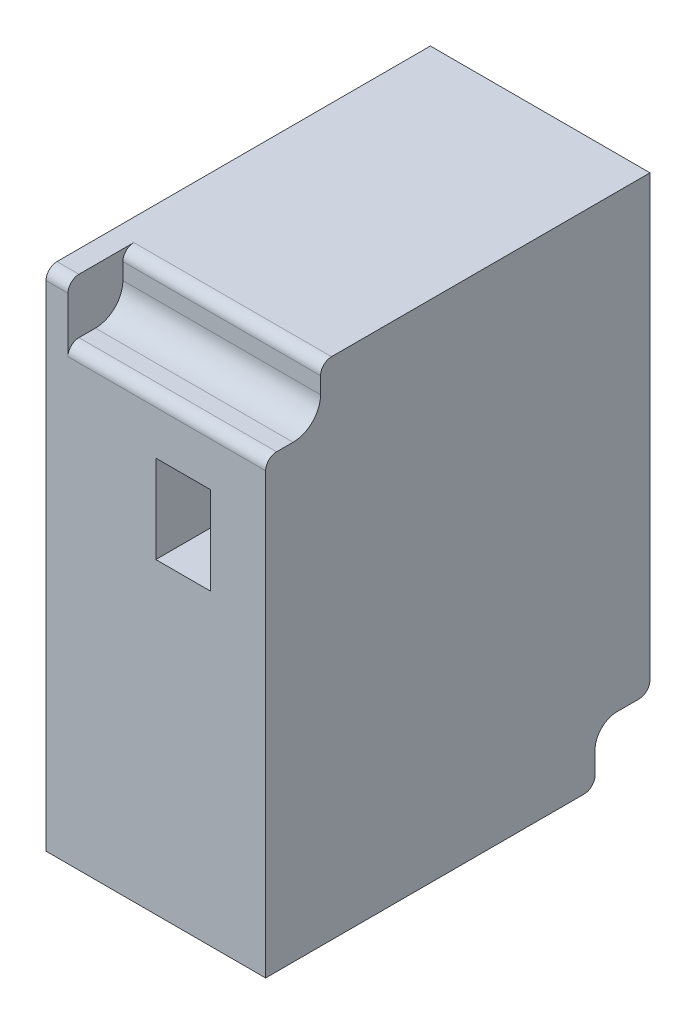
ISO-10303-21;
HEADER;
FILE_DESCRIPTION(('STEP AP214'),'2;1');
FILE_NAME('part.step','',(''),(''),'','','');
FILE_SCHEMA(('AUTOMOTIVE_DESIGN { 1 0 10303 214 1 1 1 1 }'));
ENDSEC;
DATA;
#1=APPLICATION_CONTEXT('core data for automotive mechanical design processes');
#2=APPLICATION_PROTOCOL_DEFINITION('international standard','automotive_design',2000,#1);
#3=PRODUCT_CONTEXT('',#1,'mechanical');
#4=PRODUCT('Part','Part','',(#3));
#5=PRODUCT_RELATED_PRODUCT_CATEGORY('part','',(#4));
#6=PRODUCT_DEFINITION_FORMATION('','',#4);
#7=PRODUCT_DEFINITION_CONTEXT('part definition',#1,'design');
#8=PRODUCT_DEFINITION('design','',#6,#7);
#9=PRODUCT_DEFINITION_SHAPE('','',#8);
#10=(LENGTH_UNIT() NAMED_UNIT(*) SI_UNIT(.MILLI.,.METRE.));
#11=(NAMED_UNIT(*) PLANE_ANGLE_UNIT() SI_UNIT($,.RADIAN.));
#12=(NAMED_UNIT(*) SI_UNIT($,.STERADIAN.) SOLID_ANGLE_UNIT());
#13=UNCERTAINTY_MEASURE_WITH_UNIT(LENGTH_MEASURE(1.E-05),#10,'distance_accuracy_value','');
#14=(GEOMETRIC_REPRESENTATION_CONTEXT(3) GLOBAL_UNCERTAINTY_ASSIGNED_CONTEXT((#13)) GLOBAL_UNIT_ASSIGNED_CONTEXT((#10,
#11,#12)) REPRESENTATION_CONTEXT('',''));
#15=CARTESIAN_POINT('',(0.,0.,0.));
#16=DIRECTION('',(0.,0.,1.));
#17=DIRECTION('',(1.,0.,0.));
#18=AXIS2_PLACEMENT_3D('',#15,#16,#17);
#19=CARTESIAN_POINT('',(0.,46.,-35.));
#20=DIRECTION('',(-1.,0.,0.));
#21=DIRECTION('',(0.,0.,1.));
#22=AXIS2_PLACEMENT_3D('',#19,#20,#21);
#23=PLANE('',#22);
#24=DIRECTION('',(0.,-1.,0.));
#25=VECTOR('',#24,1.);
#26=CARTESIAN_POINT('',(0.,46.,-35.));
#27=LINE('',#26,#25);
#28=CARTESIAN_POINT('',(0.,46.,-35.));
#29=VERTEX_POINT('',#28);
#30=CARTESIAN_POINT('',(0.,1.,-35.));
#31=VERTEX_POINT('',#30);
#32=EDGE_CURVE('E247',#29,#31,#27,.T.);
#33=ORIENTED_EDGE('',*,*,#32,.T.);
#34=CARTESIAN_POINT('',(0.,1.,-34.));
#35=DIRECTION('',(-1.,0.,0.));
#36=DIRECTION('',(0.,0.,1.));
#37=AXIS2_PLACEMENT_3D('',#34,#35,#36);
#38=CIRCLE('',#37,1.);
#39=CARTESIAN_POINT('',(0.,0.,-34.));
#40=VERTEX_POINT('',#39);
#41=EDGE_CURVE('E334',#31,#40,#38,.T.);
#42=ORIENTED_EDGE('',*,*,#41,.T.);
#43=DIRECTION('',(0.,0.,1.));
#44=VECTOR('',#43,1.);
#45=CARTESIAN_POINT('',(0.,0.,-35.));
#46=LINE('',#45,#44);
#47=CARTESIAN_POINT('',(0.,0.,0.));
#48=VERTEX_POINT('',#47);
#49=EDGE_CURVE('E256',#40,#48,#46,.T.);
#50=ORIENTED_EDGE('',*,*,#49,.T.);
#51=DIRECTION('',(0.,-1.,0.));
#52=VECTOR('',#51,1.);
#53=CARTESIAN_POINT('',(0.,46.,0.));
#54=LINE('',#53,#52);
#55=CARTESIAN_POINT('',(0.,45.,0.));
#56=VERTEX_POINT('',#55);
#57=EDGE_CURVE('E227',#56,#48,#54,.T.);
#58=ORIENTED_EDGE('',*,*,#57,.F.);
#59=CARTESIAN_POINT('',(0.,45.,-1.));
#60=DIRECTION('',(-1.,0.,0.));
#61=DIRECTION('',(0.,0.,1.));
#62=AXIS2_PLACEMENT_3D('',#59,#60,#61);
#63=CIRCLE('',#62,1.);
#64=CARTESIAN_POINT('',(0.,46.,-1.));
#65=VERTEX_POINT('',#64);
#66=EDGE_CURVE('E286',#56,#65,#63,.T.);
#67=ORIENTED_EDGE('',*,*,#66,.T.);
#68=DIRECTION('',(0.,0.,1.));
#69=VECTOR('',#68,1.);
#70=CARTESIAN_POINT('',(0.,46.,-35.));
#71=LINE('',#70,#69);
#72=EDGE_CURVE('E264',#29,#65,#71,.T.);
#73=ORIENTED_EDGE('',*,*,#72,.F.);
#74=EDGE_LOOP('',(#33,#42,#50,#58,#67,#73));
#75=FACE_BOUND('',#74,.T.);
#76=ADVANCED_FACE('F33',(#75),#23,.T.);
#77=CARTESIAN_POINT('',(20.,46.,-35.));
#78=DIRECTION('',(0.,1.,0.));
#79=DIRECTION('',(0.,0.,1.));
#80=AXIS2_PLACEMENT_3D('',#77,#78,#79);
#81=PLANE('',#80);
#82=DIRECTION('',(0.,0.,1.));
#83=VECTOR('',#82,1.);
#84=CARTESIAN_POINT('',(2.,46.,-5.));
#85=LINE('',#84,#83);
#86=CARTESIAN_POINT('',(2.,46.,-6.));
#87=VERTEX_POINT('',#86);
#88=CARTESIAN_POINT('',(2.,46.,-1.));
#89=VERTEX_POINT('',#88);
#90=EDGE_CURVE('E242',#87,#89,#85,.T.);
#91=ORIENTED_EDGE('',*,*,#90,.F.);
#92=DIRECTION('',(-1.,0.,0.));
#93=VECTOR('',#92,1.);
#94=CARTESIAN_POINT('',(20.,46.,-6.));
#95=LINE('',#94,#93);
#96=CARTESIAN_POINT('',(20.,46.,-6.));
#97=VERTEX_POINT('',#96);
#98=EDGE_CURVE('E305',#87,#97,#95,.F.);
#99=ORIENTED_EDGE('',*,*,#98,.T.);
#100=DIRECTION('',(0.,0.,1.));
#101=VECTOR('',#100,1.);
#102=CARTESIAN_POINT('',(20.,46.,-35.));
#103=LINE('',#102,#101);
#104=CARTESIAN_POINT('',(20.,46.,-35.));
#105=VERTEX_POINT('',#104);
#106=EDGE_CURVE('E268',#105,#97,#103,.T.);
#107=ORIENTED_EDGE('',*,*,#106,.F.);
#108=DIRECTION('',(-1.,0.,0.));
#109=VECTOR('',#108,1.);
#110=CARTESIAN_POINT('',(20.,46.,-35.));
#111=LINE('',#110,#109);
#112=EDGE_CURVE('E253',#105,#29,#111,.T.);
#113=ORIENTED_EDGE('',*,*,#112,.T.);
#114=ORIENTED_EDGE('',*,*,#72,.T.);
#115=DIRECTION('',(-1.,0.,0.));
#116=VECTOR('',#115,1.);
#117=CARTESIAN_POINT('',(20.,46.,-1.));
#118=LINE('',#117,#116);
#119=EDGE_CURVE('E288',#65,#89,#118,.F.);
#120=ORIENTED_EDGE('',*,*,#119,.T.);
#121=EDGE_LOOP('',(#91,#99,#107,#113,#114,#120));
#122=FACE_BOUND('',#121,.T.);
#123=ADVANCED_FACE('F414',(#122),#81,.T.);
#124=CARTESIAN_POINT('',(20.,0.,-35.));
#125=DIRECTION('',(1.,0.,0.));
#126=DIRECTION('',(0.,0.,-1.));
#127=AXIS2_PLACEMENT_3D('',#124,#125,#126);
#128=PLANE('',#127);
#129=DIRECTION('',(0.,0.,1.));
#130=VECTOR('',#129,1.);
#131=CARTESIAN_POINT('',(20.,0.,-35.));
#132=LINE('',#131,#130);
#133=CARTESIAN_POINT('',(20.,0.,-29.));
#134=VERTEX_POINT('',#133);
#135=CARTESIAN_POINT('',(20.,0.,0.));
#136=VERTEX_POINT('',#135);
#137=EDGE_CURVE('E271',#134,#136,#132,.T.);
#138=ORIENTED_EDGE('',*,*,#137,.F.);
#139=CARTESIAN_POINT('',(20.,1.,-29.));
#140=DIRECTION('',(1.,0.,0.));
#141=DIRECTION('',(0.,0.,-1.));
#142=AXIS2_PLACEMENT_3D('',#139,#140,#141);
#143=CIRCLE('',#142,1.);
#144=CARTESIAN_POINT('',(20.,1.,-30.));
#145=VERTEX_POINT('',#144);
#146=EDGE_CURVE('E56',#134,#145,#143,.T.);
#147=ORIENTED_EDGE('',*,*,#146,.T.);
#148=DIRECTION('',(0.,-1.,0.));
#149=VECTOR('',#148,1.);
#150=CARTESIAN_POINT('',(20.,0.,-30.));
#151=LINE('',#150,#149);
#152=CARTESIAN_POINT('',(20.,3.,-30.));
#153=VERTEX_POINT('',#152);
#154=EDGE_CURVE('E376',#153,#145,#151,.T.);
#155=ORIENTED_EDGE('',*,*,#154,.F.);
#156=CARTESIAN_POINT('',(20.,3.,-32.));
#157=DIRECTION('',(1.,0.,0.));
#158=DIRECTION('',(0.,0.,-1.));
#159=AXIS2_PLACEMENT_3D('',#156,#157,#158);
#160=CIRCLE('',#159,2.);
#161=CARTESIAN_POINT('',(20.,5.,-32.));
#162=VERTEX_POINT('',#161);
#163=EDGE_CURVE('E320',#153,#162,#160,.F.);
#164=ORIENTED_EDGE('',*,*,#163,.T.);
#165=DIRECTION('',(0.,0.,-1.));
#166=VECTOR('',#165,1.);
#167=CARTESIAN_POINT('',(20.,5.,-30.));
#168=LINE('',#167,#166);
#169=CARTESIAN_POINT('',(20.,5.,-34.));
#170=VERTEX_POINT('',#169);
#171=EDGE_CURVE('E386',#162,#170,#168,.T.);
#172=ORIENTED_EDGE('',*,*,#171,.T.);
#173=CARTESIAN_POINT('',(20.,6.,-34.));
#174=DIRECTION('',(1.,0.,0.));
#175=DIRECTION('',(0.,0.,-1.));
#176=AXIS2_PLACEMENT_3D('',#173,#174,#175);
#177=CIRCLE('',#176,1.);
#178=CARTESIAN_POINT('',(20.,6.,-35.));
#179=VERTEX_POINT('',#178);
#180=EDGE_CURVE('E48',#170,#179,#177,.T.);
#181=ORIENTED_EDGE('',*,*,#180,.T.);
#182=DIRECTION('',(0.,1.,0.));
#183=VECTOR('',#182,1.);
#184=CARTESIAN_POINT('',(20.,0.,-35.));
#185=LINE('',#184,#183);
#186=EDGE_CURVE('E250',#179,#105,#185,.T.);
#187=ORIENTED_EDGE('',*,*,#186,.T.);
#188=ORIENTED_EDGE('',*,*,#106,.T.);
#189=CARTESIAN_POINT('',(20.,45.,-6.));
#190=DIRECTION('',(1.,0.,0.));
#191=DIRECTION('',(0.,0.,-1.));
#192=AXIS2_PLACEMENT_3D('',#189,#190,#191);
#193=CIRCLE('',#192,1.);
#194=CARTESIAN_POINT('',(20.,45.,-5.));
#195=VERTEX_POINT('',#194);
#196=EDGE_CURVE('E295',#97,#195,#193,.T.);
#197=ORIENTED_EDGE('',*,*,#196,.T.);
#198=DIRECTION('',(0.,1.,0.));
#199=VECTOR('',#198,1.);
#200=CARTESIAN_POINT('',(20.,46.,-5.));
#201=LINE('',#200,#199);
#202=CARTESIAN_POINT('',(20.,43.5,-5.));
#203=VERTEX_POINT('',#202);
#204=EDGE_CURVE('E231',#203,#195,#201,.T.);
#205=ORIENTED_EDGE('',*,*,#204,.F.);
#206=CARTESIAN_POINT('',(20.,43.5,-2.5));
#207=DIRECTION('',(1.,0.,0.));
#208=DIRECTION('',(0.,0.,-1.));
#209=AXIS2_PLACEMENT_3D('',#206,#207,#208);
#210=CIRCLE('',#209,2.5);
#211=CARTESIAN_POINT('',(20.,41.,-2.5));
#212=VERTEX_POINT('',#211);
#213=EDGE_CURVE('E281',#203,#212,#210,.F.);
#214=ORIENTED_EDGE('',*,*,#213,.T.);
#215=DIRECTION('',(0.,0.,1.));
#216=VECTOR('',#215,1.);
#217=CARTESIAN_POINT('',(20.,41.,-5.));
#218=LINE('',#217,#216);
#219=CARTESIAN_POINT('',(20.,41.,-1.));
#220=VERTEX_POINT('',#219);
#221=EDGE_CURVE('E237',#212,#220,#218,.T.);
#222=ORIENTED_EDGE('',*,*,#221,.T.);
#223=CARTESIAN_POINT('',(20.,40.,-1.));
#224=DIRECTION('',(1.,0.,0.));
#225=DIRECTION('',(0.,0.,-1.));
#226=AXIS2_PLACEMENT_3D('',#223,#224,#225);
#227=CIRCLE('',#226,1.);
#228=CARTESIAN_POINT('',(20.,40.,0.));
#229=VERTEX_POINT('',#228);
#230=EDGE_CURVE('E297',#220,#229,#227,.T.);
#231=ORIENTED_EDGE('',*,*,#230,.T.);
#232=DIRECTION('',(0.,1.,0.));
#233=VECTOR('',#232,1.);
#234=CARTESIAN_POINT('',(20.,0.,0.));
#235=LINE('',#234,#233);
#236=EDGE_CURVE('E251',#136,#229,#235,.T.);
#237=ORIENTED_EDGE('',*,*,#236,.F.);
#238=EDGE_LOOP('',(#138,#147,#155,#164,#172,#181,#187,#188,#197,#205,#214,#222,#231,#237));
#239=FACE_BOUND('',#238,.T.);
#240=ADVANCED_FACE('F358',(#239),#128,.T.);
#241=CARTESIAN_POINT('',(0.,0.,-35.));
#242=DIRECTION('',(0.,-1.,0.));
#243=DIRECTION('',(0.,0.,-1.));
#244=AXIS2_PLACEMENT_3D('',#241,#242,#243);
#245=PLANE('',#244);
#246=ORIENTED_EDGE('',*,*,#49,.F.);
#247=DIRECTION('',(1.,0.,0.));
#248=VECTOR('',#247,1.);
#249=CARTESIAN_POINT('',(5.,0.,-34.));
#250=LINE('',#249,#248);
#251=CARTESIAN_POINT('',(5.,0.,-34.));
#252=VERTEX_POINT('',#251);
#253=EDGE_CURVE('E324',#40,#252,#250,.T.);
#254=ORIENTED_EDGE('',*,*,#253,.T.);
#255=DIRECTION('',(0.,0.,-1.));
#256=VECTOR('',#255,1.);
#257=CARTESIAN_POINT('',(5.,0.,-30.));
#258=LINE('',#257,#256);
#259=CARTESIAN_POINT('',(5.,0.,-29.));
#260=VERTEX_POINT('',#259);
#261=EDGE_CURVE('E348',#260,#252,#258,.T.);
#262=ORIENTED_EDGE('',*,*,#261,.F.);
#263=DIRECTION('',(-1.,0.,0.));
#264=VECTOR('',#263,1.);
#265=CARTESIAN_POINT('',(20.,0.,-29.));
#266=LINE('',#265,#264);
#267=EDGE_CURVE('E322',#260,#134,#266,.F.);
#268=ORIENTED_EDGE('',*,*,#267,.T.);
#269=ORIENTED_EDGE('',*,*,#137,.T.);
#270=DIRECTION('',(1.,0.,0.));
#271=VECTOR('',#270,1.);
#272=CARTESIAN_POINT('',(0.,0.,0.));
#273=LINE('',#272,#271);
#274=EDGE_CURVE('E259',#48,#136,#273,.T.);
#275=ORIENTED_EDGE('',*,*,#274,.F.);
#276=EDGE_LOOP('',(#246,#254,#262,#268,#269,#275));
#277=FACE_BOUND('',#276,.T.);
#278=ADVANCED_FACE('F355',(#277),#245,.T.);
#279=CARTESIAN_POINT('',(0.,0.,-35.));
#280=DIRECTION('',(0.,0.,1.));
#281=DIRECTION('',(1.,0.,0.));
#282=AXIS2_PLACEMENT_3D('',#279,#280,#281);
#283=PLANE('',#282);
#284=CARTESIAN_POINT('',(10.,36.,-35.));
#285=DIRECTION('',(0.,0.,-1.));
#286=DIRECTION('',(-1.,0.,0.));
#287=AXIS2_PLACEMENT_3D('',#284,#285,#286);
#288=CIRCLE('',#287,9.);
#289=CARTESIAN_POINT('',(0.999999999999997,36.,-35.));
#290=VERTEX_POINT('',#289);
#291=EDGE_CURVE('E214',#290,#290,#288,.T.);
#292=ORIENTED_EDGE('',*,*,#291,.F.);
#293=EDGE_LOOP('',(#292));
#294=FACE_BOUND('',#293,.T.);
#295=DIRECTION('',(0.,1.,0.));
#296=VECTOR('',#295,1.);
#297=CARTESIAN_POINT('',(5.,5.,-35.));
#298=LINE('',#297,#296);
#299=CARTESIAN_POINT('',(5.,1.,-35.));
#300=VERTEX_POINT('',#299);
#301=CARTESIAN_POINT('',(5.,6.,-35.));
#302=VERTEX_POINT('',#301);
#303=EDGE_CURVE('E370',#300,#302,#298,.T.);
#304=ORIENTED_EDGE('',*,*,#303,.F.);
#305=DIRECTION('',(1.,0.,0.));
#306=VECTOR('',#305,1.);
#307=CARTESIAN_POINT('',(0.,1.,-35.));
#308=LINE('',#307,#306);
#309=EDGE_CURVE('E332',#300,#31,#308,.F.);
#310=ORIENTED_EDGE('',*,*,#309,.T.);
#311=ORIENTED_EDGE('',*,*,#32,.F.);
#312=ORIENTED_EDGE('',*,*,#112,.F.);
#313=ORIENTED_EDGE('',*,*,#186,.F.);
#314=DIRECTION('',(1.,0.,0.));
#315=VECTOR('',#314,1.);
#316=CARTESIAN_POINT('',(0.,6.,-35.));
#317=LINE('',#316,#315);
#318=EDGE_CURVE('E329',#179,#302,#317,.F.);
#319=ORIENTED_EDGE('',*,*,#318,.T.);
#320=EDGE_LOOP('',(#304,#310,#311,#312,#313,#319));
#321=FACE_BOUND('',#320,.T.);
#322=ADVANCED_FACE('F372',(#294,#321),#283,.F.);
#323=CARTESIAN_POINT('',(0.,0.,0.));
#324=DIRECTION('',(0.,0.,1.));
#325=DIRECTION('',(1.,0.,0.));
#326=AXIS2_PLACEMENT_3D('',#323,#324,#325);
#327=PLANE('',#326);
#328=DIRECTION('',(0.,-1.,0.));
#329=VECTOR('',#328,1.);
#330=CARTESIAN_POINT('',(10.,28.,0.));
#331=LINE('',#330,#329);
#332=CARTESIAN_POINT('',(10.,36.,0.));
#333=VERTEX_POINT('',#332);
#334=CARTESIAN_POINT('',(10.,28.,0.));
#335=VERTEX_POINT('',#334);
#336=EDGE_CURVE('E191',#333,#335,#331,.T.);
#337=ORIENTED_EDGE('',*,*,#336,.F.);
#338=DIRECTION('',(-1.,0.,0.));
#339=VECTOR('',#338,1.);
#340=CARTESIAN_POINT('',(10.,36.,0.));
#341=LINE('',#340,#339);
#342=CARTESIAN_POINT('',(15.,36.,0.));
#343=VERTEX_POINT('',#342);
#344=EDGE_CURVE('E208',#343,#333,#341,.T.);
#345=ORIENTED_EDGE('',*,*,#344,.F.);
#346=DIRECTION('',(0.,1.,0.));
#347=VECTOR('',#346,1.);
#348=CARTESIAN_POINT('',(15.,36.,0.));
#349=LINE('',#348,#347);
#350=CARTESIAN_POINT('',(15.,28.,0.));
#351=VERTEX_POINT('',#350);
#352=EDGE_CURVE('E211',#351,#343,#349,.T.);
#353=ORIENTED_EDGE('',*,*,#352,.F.);
#354=DIRECTION('',(1.,0.,0.));
#355=VECTOR('',#354,1.);
#356=CARTESIAN_POINT('',(15.,28.,0.));
#357=LINE('',#356,#355);
#358=EDGE_CURVE('E220',#335,#351,#357,.T.);
#359=ORIENTED_EDGE('',*,*,#358,.F.);
#360=EDGE_LOOP('',(#337,#345,#353,#359));
#361=FACE_BOUND('',#360,.T.);
#362=ORIENTED_EDGE('',*,*,#236,.T.);
#363=DIRECTION('',(1.,0.,0.));
#364=VECTOR('',#363,1.);
#365=CARTESIAN_POINT('',(2.,40.,0.));
#366=LINE('',#365,#364);
#367=CARTESIAN_POINT('',(2.,40.,0.));
#368=VERTEX_POINT('',#367);
#369=EDGE_CURVE('E299',#229,#368,#366,.F.);
#370=ORIENTED_EDGE('',*,*,#369,.T.);
#371=DIRECTION('',(0.,-1.,0.));
#372=VECTOR('',#371,1.);
#373=CARTESIAN_POINT('',(2.,41.,0.));
#374=LINE('',#373,#372);
#375=CARTESIAN_POINT('',(2.,45.,0.));
#376=VERTEX_POINT('',#375);
#377=EDGE_CURVE('E235',#376,#368,#374,.T.);
#378=ORIENTED_EDGE('',*,*,#377,.F.);
#379=DIRECTION('',(-1.,0.,0.));
#380=VECTOR('',#379,1.);
#381=CARTESIAN_POINT('',(0.,45.,0.));
#382=LINE('',#381,#380);
#383=EDGE_CURVE('E283',#376,#56,#382,.T.);
#384=ORIENTED_EDGE('',*,*,#383,.T.);
#385=ORIENTED_EDGE('',*,*,#57,.T.);
#386=ORIENTED_EDGE('',*,*,#274,.T.);
#387=EDGE_LOOP('',(#362,#370,#378,#384,#385,#386));
#388=FACE_BOUND('',#387,.T.);
#389=ADVANCED_FACE('F361',(#361,#388),#327,.T.);
#390=CARTESIAN_POINT('',(10.,41.,-5.));
#391=DIRECTION('',(0.,-1.,0.));
#392=DIRECTION('',(0.,0.,-1.));
#393=AXIS2_PLACEMENT_3D('',#390,#391,#392);
#394=PLANE('',#393);
#395=DIRECTION('',(0.,0.,1.));
#396=VECTOR('',#395,1.);
#397=CARTESIAN_POINT('',(2.,41.,-5.));
#398=LINE('',#397,#396);
#399=CARTESIAN_POINT('',(2.,41.,-2.5));
#400=VERTEX_POINT('',#399);
#401=CARTESIAN_POINT('',(2.,41.,-1.));
#402=VERTEX_POINT('',#401);
#403=EDGE_CURVE('E221',#400,#402,#398,.T.);
#404=ORIENTED_EDGE('',*,*,#403,.T.);
#405=DIRECTION('',(1.,0.,0.));
#406=VECTOR('',#405,1.);
#407=CARTESIAN_POINT('',(20.,41.,-1.));
#408=LINE('',#407,#406);
#409=EDGE_CURVE('E292',#402,#220,#408,.T.);
#410=ORIENTED_EDGE('',*,*,#409,.T.);
#411=ORIENTED_EDGE('',*,*,#221,.F.);
#412=DIRECTION('',(1.,0.,0.));
#413=VECTOR('',#412,1.);
#414=CARTESIAN_POINT('',(2.,41.,-2.5));
#415=LINE('',#414,#413);
#416=EDGE_CURVE('E276',#212,#400,#415,.F.);
#417=ORIENTED_EDGE('',*,*,#416,.T.);
#418=EDGE_LOOP('',(#404,#410,#411,#417));
#419=FACE_BOUND('',#418,.T.);
#420=ADVANCED_FACE('F477',(#419),#394,.F.);
#421=CARTESIAN_POINT('',(2.,41.,-5.));
#422=DIRECTION('',(-1.,0.,0.));
#423=DIRECTION('',(0.,-1.,0.));
#424=AXIS2_PLACEMENT_3D('',#421,#422,#423);
#425=PLANE('',#424);
#426=ORIENTED_EDGE('',*,*,#90,.T.);
#427=CARTESIAN_POINT('',(2.,45.,-1.));
#428=DIRECTION('',(-1.,0.,0.));
#429=DIRECTION('',(0.,-1.,0.));
#430=AXIS2_PLACEMENT_3D('',#427,#428,#429);
#431=CIRCLE('',#430,1.);
#432=EDGE_CURVE('E290',#89,#376,#431,.F.);
#433=ORIENTED_EDGE('',*,*,#432,.T.);
#434=ORIENTED_EDGE('',*,*,#377,.T.);
#435=CARTESIAN_POINT('',(2.,40.,-1.));
#436=DIRECTION('',(-1.,0.,0.));
#437=DIRECTION('',(0.,-1.,0.));
#438=AXIS2_PLACEMENT_3D('',#435,#436,#437);
#439=CIRCLE('',#438,1.);
#440=EDGE_CURVE('E307',#368,#402,#439,.T.);
#441=ORIENTED_EDGE('',*,*,#440,.T.);
#442=ORIENTED_EDGE('',*,*,#403,.F.);
#443=CARTESIAN_POINT('',(2.,43.5,-2.5));
#444=DIRECTION('',(-1.,0.,0.));
#445=DIRECTION('',(0.,-1.,0.));
#446=AXIS2_PLACEMENT_3D('',#443,#444,#445);
#447=CIRCLE('',#446,2.5);
#448=CARTESIAN_POINT('',(2.,43.5,-5.));
#449=VERTEX_POINT('',#448);
#450=EDGE_CURVE('E278',#400,#449,#447,.F.);
#451=ORIENTED_EDGE('',*,*,#450,.T.);
#452=DIRECTION('',(0.,-1.,0.));
#453=VECTOR('',#452,1.);
#454=CARTESIAN_POINT('',(2.,41.,-5.));
#455=LINE('',#454,#453);
#456=CARTESIAN_POINT('',(2.,45.,-5.));
#457=VERTEX_POINT('',#456);
#458=EDGE_CURVE('E234',#457,#449,#455,.T.);
#459=ORIENTED_EDGE('',*,*,#458,.F.);
#460=CARTESIAN_POINT('',(2.,45.,-6.));
#461=DIRECTION('',(-1.,0.,0.));
#462=DIRECTION('',(0.,-1.,0.));
#463=AXIS2_PLACEMENT_3D('',#460,#461,#462);
#464=CIRCLE('',#463,1.);
#465=EDGE_CURVE('E309',#457,#87,#464,.T.);
#466=ORIENTED_EDGE('',*,*,#465,.T.);
#467=EDGE_LOOP('',(#426,#433,#434,#441,#442,#451,#459,#466));
#468=FACE_BOUND('',#467,.T.);
#469=ADVANCED_FACE('F470',(#468),#425,.F.);
#470=CARTESIAN_POINT('',(0.,0.,-5.));
#471=DIRECTION('',(0.,0.,-1.));
#472=DIRECTION('',(-1.,0.,0.));
#473=AXIS2_PLACEMENT_3D('',#470,#471,#472);
#474=PLANE('',#473);
#475=ORIENTED_EDGE('',*,*,#204,.T.);
#476=DIRECTION('',(-1.,0.,0.));
#477=VECTOR('',#476,1.);
#478=CARTESIAN_POINT('',(2.,45.,-5.));
#479=LINE('',#478,#477);
#480=EDGE_CURVE('E302',#195,#457,#479,.T.);
#481=ORIENTED_EDGE('',*,*,#480,.T.);
#482=ORIENTED_EDGE('',*,*,#458,.T.);
#483=DIRECTION('',(1.,0.,0.));
#484=VECTOR('',#483,1.);
#485=CARTESIAN_POINT('',(20.,43.5,-5.));
#486=LINE('',#485,#484);
#487=EDGE_CURVE('E267',#449,#203,#486,.T.);
#488=ORIENTED_EDGE('',*,*,#487,.T.);
#489=EDGE_LOOP('',(#475,#481,#482,#488));
#490=FACE_BOUND('',#489,.T.);
#491=ADVANCED_FACE('F468',(#490),#474,.F.);
#492=CARTESIAN_POINT('',(10.,28.,-5.));
#493=DIRECTION('',(-1.,0.,0.));
#494=DIRECTION('',(0.,0.,1.));
#495=AXIS2_PLACEMENT_3D('',#492,#493,#494);
#496=PLANE('',#495);
#497=ORIENTED_EDGE('',*,*,#336,.T.);
#498=DIRECTION('',(0.,0.,1.));
#499=VECTOR('',#498,1.);
#500=CARTESIAN_POINT('',(10.,28.,-5.));
#501=LINE('',#500,#499);
#502=CARTESIAN_POINT('',(10.,28.,-5.));
#503=VERTEX_POINT('',#502);
#504=EDGE_CURVE('E184',#503,#335,#501,.T.);
#505=ORIENTED_EDGE('',*,*,#504,.F.);
#506=DIRECTION('',(0.,-1.,0.));
#507=VECTOR('',#506,1.);
#508=CARTESIAN_POINT('',(10.,28.,-5.));
#509=LINE('',#508,#507);
#510=CARTESIAN_POINT('',(10.,36.,-5.));
#511=VERTEX_POINT('',#510);
#512=EDGE_CURVE('E188',#511,#503,#509,.T.);
#513=ORIENTED_EDGE('',*,*,#512,.F.);
#514=DIRECTION('',(0.,0.,1.));
#515=VECTOR('',#514,1.);
#516=CARTESIAN_POINT('',(10.,36.,-5.));
#517=LINE('',#516,#515);
#518=EDGE_CURVE('E225',#511,#333,#517,.T.);
#519=ORIENTED_EDGE('',*,*,#518,.T.);
#520=EDGE_LOOP('',(#497,#505,#513,#519));
#521=FACE_BOUND('',#520,.T.);
#522=ADVANCED_FACE('F186',(#521),#496,.F.);
#523=CARTESIAN_POINT('',(10.,36.,-5.));
#524=DIRECTION('',(0.,1.,0.));
#525=DIRECTION('',(0.,0.,1.));
#526=AXIS2_PLACEMENT_3D('',#523,#524,#525);
#527=PLANE('',#526);
#528=ORIENTED_EDGE('',*,*,#344,.T.);
#529=ORIENTED_EDGE('',*,*,#518,.F.);
#530=DIRECTION('',(-1.,0.,0.));
#531=VECTOR('',#530,1.);
#532=CARTESIAN_POINT('',(10.,36.,-5.));
#533=LINE('',#532,#531);
#534=CARTESIAN_POINT('',(15.,36.,-5.));
#535=VERTEX_POINT('',#534);
#536=EDGE_CURVE('E196',#535,#511,#533,.T.);
#537=ORIENTED_EDGE('',*,*,#536,.F.);
#538=DIRECTION('',(0.,0.,1.));
#539=VECTOR('',#538,1.);
#540=CARTESIAN_POINT('',(15.,36.,-5.));
#541=LINE('',#540,#539);
#542=EDGE_CURVE('E228',#535,#343,#541,.T.);
#543=ORIENTED_EDGE('',*,*,#542,.T.);
#544=EDGE_LOOP('',(#528,#529,#537,#543));
#545=FACE_BOUND('',#544,.T.);
#546=ADVANCED_FACE('F641',(#545),#527,.F.);
#547=CARTESIAN_POINT('',(15.,36.,-5.));
#548=DIRECTION('',(1.,0.,0.));
#549=DIRECTION('',(0.,1.,0.));
#550=AXIS2_PLACEMENT_3D('',#547,#548,#549);
#551=PLANE('',#550);
#552=ORIENTED_EDGE('',*,*,#352,.T.);
#553=ORIENTED_EDGE('',*,*,#542,.F.);
#554=DIRECTION('',(0.,1.,0.));
#555=VECTOR('',#554,1.);
#556=CARTESIAN_POINT('',(15.,36.,-5.));
#557=LINE('',#556,#555);
#558=CARTESIAN_POINT('',(15.,28.,-5.));
#559=VERTEX_POINT('',#558);
#560=EDGE_CURVE('E204',#559,#535,#557,.T.);
#561=ORIENTED_EDGE('',*,*,#560,.F.);
#562=DIRECTION('',(0.,0.,1.));
#563=VECTOR('',#562,1.);
#564=CARTESIAN_POINT('',(15.,28.,-5.));
#565=LINE('',#564,#563);
#566=EDGE_CURVE('E195',#559,#351,#565,.T.);
#567=ORIENTED_EDGE('',*,*,#566,.T.);
#568=EDGE_LOOP('',(#552,#553,#561,#567));
#569=FACE_BOUND('',#568,.T.);
#570=ADVANCED_FACE('F644',(#569),#551,.F.);
#571=CARTESIAN_POINT('',(15.,28.,-5.));
#572=DIRECTION('',(0.,-1.,0.));
#573=DIRECTION('',(0.,0.,-1.));
#574=AXIS2_PLACEMENT_3D('',#571,#572,#573);
#575=PLANE('',#574);
#576=ORIENTED_EDGE('',*,*,#358,.T.);
#577=ORIENTED_EDGE('',*,*,#566,.F.);
#578=DIRECTION('',(1.,0.,0.));
#579=VECTOR('',#578,1.);
#580=CARTESIAN_POINT('',(15.,28.,-5.));
#581=LINE('',#580,#579);
#582=EDGE_CURVE('E199',#503,#559,#581,.T.);
#583=ORIENTED_EDGE('',*,*,#582,.F.);
#584=ORIENTED_EDGE('',*,*,#504,.T.);
#585=EDGE_LOOP('',(#576,#577,#583,#584));
#586=FACE_BOUND('',#585,.T.);
#587=ADVANCED_FACE('F200',(#586),#575,.F.);
#588=CARTESIAN_POINT('',(0.,0.,-5.));
#589=DIRECTION('',(0.,0.,-1.));
#590=DIRECTION('',(-1.,0.,0.));
#591=AXIS2_PLACEMENT_3D('',#588,#589,#590);
#592=PLANE('',#591);
#593=ORIENTED_EDGE('',*,*,#512,.T.);
#594=ORIENTED_EDGE('',*,*,#582,.T.);
#595=ORIENTED_EDGE('',*,*,#560,.T.);
#596=ORIENTED_EDGE('',*,*,#536,.T.);
#597=EDGE_LOOP('',(#593,#594,#595,#596));
#598=FACE_BOUND('',#597,.T.);
#599=ADVANCED_FACE('F206',(#598),#592,.F.);
#600=CARTESIAN_POINT('',(0.,43.5,-2.5));
#601=DIRECTION('',(-1.,0.,0.));
#602=DIRECTION('',(0.,0.,1.));
#603=AXIS2_PLACEMENT_3D('',#600,#601,#602);
#604=CYLINDRICAL_SURFACE('',#603,2.5);
#605=ORIENTED_EDGE('',*,*,#450,.F.);
#606=ORIENTED_EDGE('',*,*,#416,.F.);
#607=ORIENTED_EDGE('',*,*,#213,.F.);
#608=ORIENTED_EDGE('',*,*,#487,.F.);
#609=EDGE_LOOP('',(#605,#606,#607,#608));
#610=FACE_BOUND('',#609,.T.);
#611=ADVANCED_FACE('F424',(#610),#604,.F.);
#612=CARTESIAN_POINT('',(0.,45.,-1.));
#613=DIRECTION('',(-1.,0.,0.));
#614=DIRECTION('',(0.,0.,1.));
#615=AXIS2_PLACEMENT_3D('',#612,#613,#614);
#616=CYLINDRICAL_SURFACE('',#615,1.);
#617=ORIENTED_EDGE('',*,*,#432,.F.);
#618=ORIENTED_EDGE('',*,*,#119,.F.);
#619=ORIENTED_EDGE('',*,*,#66,.F.);
#620=ORIENTED_EDGE('',*,*,#383,.F.);
#621=EDGE_LOOP('',(#617,#618,#619,#620));
#622=FACE_BOUND('',#621,.T.);
#623=ADVANCED_FACE('F427',(#622),#616,.T.);
#624=CARTESIAN_POINT('',(10.,40.,-1.));
#625=DIRECTION('',(-1.,0.,0.));
#626=DIRECTION('',(0.,0.,1.));
#627=AXIS2_PLACEMENT_3D('',#624,#625,#626);
#628=CYLINDRICAL_SURFACE('',#627,1.);
#629=ORIENTED_EDGE('',*,*,#440,.F.);
#630=ORIENTED_EDGE('',*,*,#369,.F.);
#631=ORIENTED_EDGE('',*,*,#230,.F.);
#632=ORIENTED_EDGE('',*,*,#409,.F.);
#633=EDGE_LOOP('',(#629,#630,#631,#632));
#634=FACE_BOUND('',#633,.T.);
#635=ADVANCED_FACE('F431',(#634),#628,.T.);
#636=CARTESIAN_POINT('',(0.,45.,-6.));
#637=DIRECTION('',(1.,0.,0.));
#638=DIRECTION('',(0.,0.,-1.));
#639=AXIS2_PLACEMENT_3D('',#636,#637,#638);
#640=CYLINDRICAL_SURFACE('',#639,1.);
#641=ORIENTED_EDGE('',*,*,#196,.F.);
#642=ORIENTED_EDGE('',*,*,#98,.F.);
#643=ORIENTED_EDGE('',*,*,#465,.F.);
#644=ORIENTED_EDGE('',*,*,#480,.F.);
#645=EDGE_LOOP('',(#641,#642,#643,#644));
#646=FACE_BOUND('',#645,.T.);
#647=ADVANCED_FACE('F435',(#646),#640,.T.);
#648=CARTESIAN_POINT('',(10.,36.,-30.));
#649=DIRECTION('',(0.,0.,-1.));
#650=DIRECTION('',(-1.,0.,0.));
#651=AXIS2_PLACEMENT_3D('',#648,#649,#650);
#652=CYLINDRICAL_SURFACE('',#651,9.);
#653=CARTESIAN_POINT('',(10.,36.,-30.));
#654=DIRECTION('',(0.,0.,-1.));
#655=DIRECTION('',(-1.,0.,0.));
#656=AXIS2_PLACEMENT_3D('',#653,#654,#655);
#657=CIRCLE('',#656,9.);
#658=CARTESIAN_POINT('',(0.999999999999997,36.,-30.));
#659=VERTEX_POINT('',#658);
#660=EDGE_CURVE('E377',#659,#659,#657,.T.);
#661=ORIENTED_EDGE('',*,*,#660,.F.);
#662=EDGE_LOOP('',(#661));
#663=FACE_BOUND('',#662,.T.);
#664=ORIENTED_EDGE('',*,*,#291,.T.);
#665=EDGE_LOOP('',(#664));
#666=FACE_BOUND('',#665,.T.);
#667=ADVANCED_FACE('F409',(#663,#666),#652,.F.);
#668=CARTESIAN_POINT('',(10.,36.,-30.));
#669=DIRECTION('',(0.,0.,-1.));
#670=DIRECTION('',(-1.,0.,0.));
#671=AXIS2_PLACEMENT_3D('',#668,#669,#670);
#672=PLANE('',#671);
#673=CARTESIAN_POINT('',(10.,36.,-30.));
#674=DIRECTION('',(0.,0.,-1.));
#675=DIRECTION('',(-1.,0.,0.));
#676=AXIS2_PLACEMENT_3D('',#673,#674,#675);
#677=CIRCLE('',#676,6.5);
#678=CARTESIAN_POINT('',(3.5,36.,-30.));
#679=VERTEX_POINT('',#678);
#680=EDGE_CURVE('E389',#679,#679,#677,.T.);
#681=ORIENTED_EDGE('',*,*,#680,.F.);
#682=EDGE_LOOP('',(#681));
#683=FACE_BOUND('',#682,.T.);
#684=ORIENTED_EDGE('',*,*,#660,.T.);
#685=EDGE_LOOP('',(#684));
#686=FACE_BOUND('',#685,.T.);
#687=ADVANCED_FACE('F400',(#683,#686),#672,.T.);
#688=CARTESIAN_POINT('',(10.,36.,-30.));
#689=DIRECTION('',(0.,0.,-1.));
#690=DIRECTION('',(-1.,0.,0.));
#691=AXIS2_PLACEMENT_3D('',#688,#689,#690);
#692=CYLINDRICAL_SURFACE('',#691,6.5);
#693=ORIENTED_EDGE('',*,*,#680,.T.);
#694=EDGE_LOOP('',(#693));
#695=FACE_BOUND('',#694,.T.);
#696=CARTESIAN_POINT('',(10.,36.,-35.));
#697=DIRECTION('',(0.,0.,-1.));
#698=DIRECTION('',(-1.,0.,0.));
#699=AXIS2_PLACEMENT_3D('',#696,#697,#698);
#700=CIRCLE('',#699,6.5);
#701=CARTESIAN_POINT('',(3.5,36.,-35.));
#702=VERTEX_POINT('',#701);
#703=EDGE_CURVE('E392',#702,#702,#700,.T.);
#704=ORIENTED_EDGE('',*,*,#703,.F.);
#705=EDGE_LOOP('',(#704));
#706=FACE_BOUND('',#705,.T.);
#707=ADVANCED_FACE('F398',(#695,#706),#692,.T.);
#708=CARTESIAN_POINT('',(5.,5.,-30.));
#709=DIRECTION('',(-1.,0.,0.));
#710=DIRECTION('',(0.,0.,1.));
#711=AXIS2_PLACEMENT_3D('',#708,#709,#710);
#712=PLANE('',#711);
#713=ORIENTED_EDGE('',*,*,#261,.T.);
#714=CARTESIAN_POINT('',(5.,1.,-34.));
#715=DIRECTION('',(-1.,0.,0.));
#716=DIRECTION('',(0.,0.,1.));
#717=AXIS2_PLACEMENT_3D('',#714,#715,#716);
#718=CIRCLE('',#717,1.);
#719=EDGE_CURVE('E327',#252,#300,#718,.F.);
#720=ORIENTED_EDGE('',*,*,#719,.T.);
#721=ORIENTED_EDGE('',*,*,#303,.T.);
#722=CARTESIAN_POINT('',(5.,6.,-34.));
#723=DIRECTION('',(-1.,0.,0.));
#724=DIRECTION('',(0.,0.,1.));
#725=AXIS2_PLACEMENT_3D('',#722,#723,#724);
#726=CIRCLE('',#725,1.);
#727=CARTESIAN_POINT('',(5.,5.,-34.));
#728=VERTEX_POINT('',#727);
#729=EDGE_CURVE('E11',#302,#728,#726,.T.);
#730=ORIENTED_EDGE('',*,*,#729,.T.);
#731=DIRECTION('',(0.,0.,-1.));
#732=VECTOR('',#731,1.);
#733=CARTESIAN_POINT('',(5.,5.,-30.));
#734=LINE('',#733,#732);
#735=CARTESIAN_POINT('',(5.,5.,-32.));
#736=VERTEX_POINT('',#735);
#737=EDGE_CURVE('E239',#736,#728,#734,.T.);
#738=ORIENTED_EDGE('',*,*,#737,.F.);
#739=CARTESIAN_POINT('',(5.,3.,-32.));
#740=DIRECTION('',(-1.,0.,0.));
#741=DIRECTION('',(0.,0.,1.));
#742=AXIS2_PLACEMENT_3D('',#739,#740,#741);
#743=CIRCLE('',#742,2.);
#744=CARTESIAN_POINT('',(5.,3.,-30.));
#745=VERTEX_POINT('',#744);
#746=EDGE_CURVE('E317',#736,#745,#743,.F.);
#747=ORIENTED_EDGE('',*,*,#746,.T.);
#748=DIRECTION('',(0.,1.,0.));
#749=VECTOR('',#748,1.);
#750=CARTESIAN_POINT('',(5.,5.,-30.));
#751=LINE('',#750,#749);
#752=CARTESIAN_POINT('',(5.,1.,-30.));
#753=VERTEX_POINT('',#752);
#754=EDGE_CURVE('E349',#753,#745,#751,.T.);
#755=ORIENTED_EDGE('',*,*,#754,.F.);
#756=CARTESIAN_POINT('',(5.,1.,-29.));
#757=DIRECTION('',(-1.,0.,0.));
#758=DIRECTION('',(0.,0.,1.));
#759=AXIS2_PLACEMENT_3D('',#756,#757,#758);
#760=CIRCLE('',#759,1.);
#761=EDGE_CURVE('E41',#753,#260,#760,.T.);
#762=ORIENTED_EDGE('',*,*,#761,.T.);
#763=EDGE_LOOP('',(#713,#720,#721,#730,#738,#747,#755,#762));
#764=FACE_BOUND('',#763,.T.);
#765=ADVANCED_FACE('F347',(#764),#712,.F.);
#766=CARTESIAN_POINT('',(10.,5.,-30.));
#767=DIRECTION('',(0.,1.,0.));
#768=DIRECTION('',(0.,0.,1.));
#769=AXIS2_PLACEMENT_3D('',#766,#767,#768);
#770=PLANE('',#769);
#771=ORIENTED_EDGE('',*,*,#737,.T.);
#772=DIRECTION('',(1.,0.,0.));
#773=VECTOR('',#772,1.);
#774=CARTESIAN_POINT('',(10.,5.,-34.));
#775=LINE('',#774,#773);
#776=EDGE_CURVE('E341',#728,#170,#775,.T.);
#777=ORIENTED_EDGE('',*,*,#776,.T.);
#778=ORIENTED_EDGE('',*,*,#171,.F.);
#779=DIRECTION('',(1.,0.,0.));
#780=VECTOR('',#779,1.);
#781=CARTESIAN_POINT('',(5.,5.,-32.));
#782=LINE('',#781,#780);
#783=EDGE_CURVE('E315',#162,#736,#782,.F.);
#784=ORIENTED_EDGE('',*,*,#783,.T.);
#785=EDGE_LOOP('',(#771,#777,#778,#784));
#786=FACE_BOUND('',#785,.T.);
#787=ADVANCED_FACE('F407',(#786),#770,.F.);
#788=CARTESIAN_POINT('',(0.,0.,-30.));
#789=DIRECTION('',(0.,0.,1.));
#790=DIRECTION('',(1.,0.,0.));
#791=AXIS2_PLACEMENT_3D('',#788,#789,#790);
#792=PLANE('',#791);
#793=ORIENTED_EDGE('',*,*,#154,.T.);
#794=DIRECTION('',(-1.,0.,0.));
#795=VECTOR('',#794,1.);
#796=CARTESIAN_POINT('',(5.,1.,-30.));
#797=LINE('',#796,#795);
#798=EDGE_CURVE('E336',#145,#753,#797,.T.);
#799=ORIENTED_EDGE('',*,*,#798,.T.);
#800=ORIENTED_EDGE('',*,*,#754,.T.);
#801=DIRECTION('',(1.,0.,0.));
#802=VECTOR('',#801,1.);
#803=CARTESIAN_POINT('',(20.,3.,-30.));
#804=LINE('',#803,#802);
#805=EDGE_CURVE('E312',#745,#153,#804,.T.);
#806=ORIENTED_EDGE('',*,*,#805,.T.);
#807=EDGE_LOOP('',(#793,#799,#800,#806));
#808=FACE_BOUND('',#807,.T.);
#809=ADVANCED_FACE('F458',(#808),#792,.F.);
#810=ORIENTED_EDGE('',*,*,#703,.T.);
#811=EDGE_LOOP('',(#810));
#812=FACE_BOUND('',#811,.T.);
#813=ADVANCED_FACE('F396',(#812),#283,.F.);
#814=CARTESIAN_POINT('',(0.,3.,-32.));
#815=DIRECTION('',(-1.,0.,0.));
#816=DIRECTION('',(0.,0.,1.));
#817=AXIS2_PLACEMENT_3D('',#814,#815,#816);
#818=CYLINDRICAL_SURFACE('',#817,2.);
#819=ORIENTED_EDGE('',*,*,#746,.F.);
#820=ORIENTED_EDGE('',*,*,#783,.F.);
#821=ORIENTED_EDGE('',*,*,#163,.F.);
#822=ORIENTED_EDGE('',*,*,#805,.F.);
#823=EDGE_LOOP('',(#819,#820,#821,#822));
#824=FACE_BOUND('',#823,.T.);
#825=ADVANCED_FACE('F440',(#824),#818,.F.);
#826=CARTESIAN_POINT('',(0.,1.,-34.));
#827=DIRECTION('',(-1.,0.,0.));
#828=DIRECTION('',(0.,0.,1.));
#829=AXIS2_PLACEMENT_3D('',#826,#827,#828);
#830=CYLINDRICAL_SURFACE('',#829,1.);
#831=ORIENTED_EDGE('',*,*,#41,.F.);
#832=ORIENTED_EDGE('',*,*,#309,.F.);
#833=ORIENTED_EDGE('',*,*,#719,.F.);
#834=ORIENTED_EDGE('',*,*,#253,.F.);
#835=EDGE_LOOP('',(#831,#832,#833,#834));
#836=FACE_BOUND('',#835,.T.);
#837=ADVANCED_FACE('F367',(#836),#830,.T.);
#838=CARTESIAN_POINT('',(0.,1.,-29.));
#839=DIRECTION('',(1.,0.,0.));
#840=DIRECTION('',(0.,0.,-1.));
#841=AXIS2_PLACEMENT_3D('',#838,#839,#840);
#842=CYLINDRICAL_SURFACE('',#841,1.);
#843=ORIENTED_EDGE('',*,*,#146,.F.);
#844=ORIENTED_EDGE('',*,*,#267,.F.);
#845=ORIENTED_EDGE('',*,*,#761,.F.);
#846=ORIENTED_EDGE('',*,*,#798,.F.);
#847=EDGE_LOOP('',(#843,#844,#845,#846));
#848=FACE_BOUND('',#847,.T.);
#849=ADVANCED_FACE('F352',(#848),#842,.T.);
#850=CARTESIAN_POINT('',(10.,6.,-34.));
#851=DIRECTION('',(1.,0.,0.));
#852=DIRECTION('',(0.,0.,-1.));
#853=AXIS2_PLACEMENT_3D('',#850,#851,#852);
#854=CYLINDRICAL_SURFACE('',#853,1.);
#855=ORIENTED_EDGE('',*,*,#729,.F.);
#856=ORIENTED_EDGE('',*,*,#318,.F.);
#857=ORIENTED_EDGE('',*,*,#180,.F.);
#858=ORIENTED_EDGE('',*,*,#776,.F.);
#859=EDGE_LOOP('',(#855,#856,#857,#858));
#860=FACE_BOUND('',#859,.T.);
#861=ADVANCED_FACE('F35',(#860),#854,.T.);
#862=CLOSED_SHELL('',(#76,#123,#240,#278,#322,#389,#420,#469,#491,#522,#546,#570,#587,#599,#611,
#623,#635,#647,#667,#687,#707,#765,#787,#809,#813,#825,#837,#849,#861));
#863=MANIFOLD_SOLID_BREP('B2',#862);
#864=ADVANCED_BREP_SHAPE_REPRESENTATION('',(#18,#863),#14);
#865=SHAPE_DEFINITION_REPRESENTATION(#9,#864);
ENDSEC;
END-ISO-10303-21;
